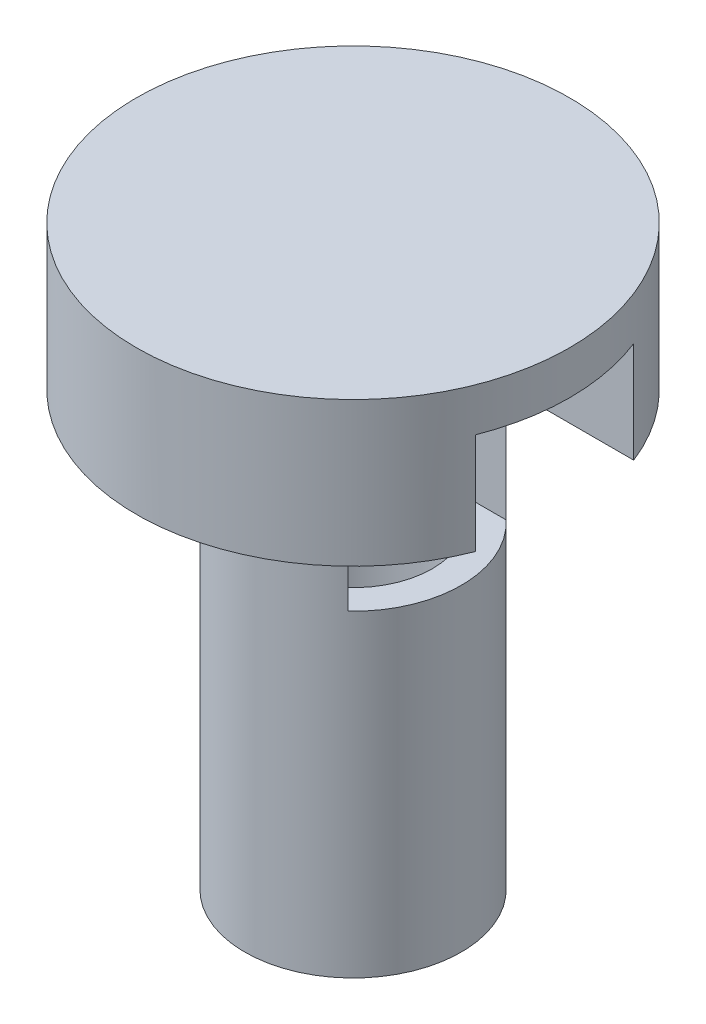
ISO-10303-21;
HEADER;
FILE_DESCRIPTION(('STEP AP214'),'2;1');
FILE_NAME('part.step','',(''),(''),'','','');
FILE_SCHEMA(('AUTOMOTIVE_DESIGN { 1 0 10303 214 1 1 1 1 }'));
ENDSEC;
DATA;
#1=APPLICATION_CONTEXT('core data for automotive mechanical design processes');
#2=APPLICATION_PROTOCOL_DEFINITION('international standard','automotive_design',2000,#1);
#3=PRODUCT_CONTEXT('',#1,'mechanical');
#4=PRODUCT('Part','Part','',(#3));
#5=PRODUCT_RELATED_PRODUCT_CATEGORY('part','',(#4));
#6=PRODUCT_DEFINITION_FORMATION('','',#4);
#7=PRODUCT_DEFINITION_CONTEXT('part definition',#1,'design');
#8=PRODUCT_DEFINITION('design','',#6,#7);
#9=PRODUCT_DEFINITION_SHAPE('','',#8);
#10=(LENGTH_UNIT() NAMED_UNIT(*) SI_UNIT(.MILLI.,.METRE.));
#11=(NAMED_UNIT(*) PLANE_ANGLE_UNIT() SI_UNIT($,.RADIAN.));
#12=(NAMED_UNIT(*) SI_UNIT($,.STERADIAN.) SOLID_ANGLE_UNIT());
#13=UNCERTAINTY_MEASURE_WITH_UNIT(LENGTH_MEASURE(1.E-05),#10,'distance_accuracy_value','');
#14=(GEOMETRIC_REPRESENTATION_CONTEXT(3) GLOBAL_UNCERTAINTY_ASSIGNED_CONTEXT((#13)) GLOBAL_UNIT_ASSIGNED_CONTEXT((#10,
#11,#12)) REPRESENTATION_CONTEXT('',''));
#15=CARTESIAN_POINT('',(0.,0.,0.));
#16=DIRECTION('',(0.,0.,1.));
#17=DIRECTION('',(1.,0.,0.));
#18=AXIS2_PLACEMENT_3D('',#15,#16,#17);
#19=CARTESIAN_POINT('',(0.,12.7,0.));
#20=DIRECTION('',(0.,-1.,0.));
#21=DIRECTION('',(0.,0.,-1.));
#22=AXIS2_PLACEMENT_3D('',#19,#20,#21);
#23=CYLINDRICAL_SURFACE('',#22,19.05);
#24=CARTESIAN_POINT('',(0.,12.7,0.));
#25=DIRECTION('',(0.,1.,0.));
#26=DIRECTION('',(0.,0.,1.));
#27=AXIS2_PLACEMENT_3D('',#24,#25,#26);
#28=CIRCLE('',#27,19.05);
#29=CARTESIAN_POINT('',(0.,12.7,19.05));
#30=VERTEX_POINT('',#29);
#31=EDGE_CURVE('E134',#30,#30,#28,.T.);
#32=ORIENTED_EDGE('',*,*,#31,.F.);
#33=EDGE_LOOP('',(#32));
#34=FACE_BOUND('',#33,.T.);
#35=DIRECTION('',(0.,-1.,0.));
#36=VECTOR('',#35,1.);
#37=CARTESIAN_POINT('',(17.7341944640203,12.7,-6.95707170527301));
#38=LINE('',#37,#36);
#39=CARTESIAN_POINT('',(17.7341944640203,0.,-6.95707170527301));
#40=VERTEX_POINT('',#39);
#41=CARTESIAN_POINT('',(17.7341944640203,8.89,-6.95707170527301));
#42=VERTEX_POINT('',#41);
#43=EDGE_CURVE('E95',#40,#42,#38,.F.);
#44=ORIENTED_EDGE('',*,*,#43,.F.);
#45=CARTESIAN_POINT('',(0.,0.,0.));
#46=DIRECTION('',(0.,1.,0.));
#47=DIRECTION('',(0.,0.,1.));
#48=AXIS2_PLACEMENT_3D('',#45,#46,#47);
#49=CIRCLE('',#48,19.05);
#50=CARTESIAN_POINT('',(17.7341944640203,0.,6.95707170527301));
#51=VERTEX_POINT('',#50);
#52=EDGE_CURVE('E108',#40,#51,#49,.T.);
#53=ORIENTED_EDGE('',*,*,#52,.T.);
#54=DIRECTION('',(0.,-1.,0.));
#55=VECTOR('',#54,1.);
#56=CARTESIAN_POINT('',(17.7341944640203,12.7,6.95707170527301));
#57=LINE('',#56,#55);
#58=CARTESIAN_POINT('',(17.7341944640203,8.89,6.95707170527301));
#59=VERTEX_POINT('',#58);
#60=EDGE_CURVE('E99',#59,#51,#57,.T.);
#61=ORIENTED_EDGE('',*,*,#60,.F.);
#62=CARTESIAN_POINT('',(0.,8.89,0.));
#63=DIRECTION('',(0.,-1.,0.));
#64=DIRECTION('',(0.,0.,-1.));
#65=AXIS2_PLACEMENT_3D('',#62,#63,#64);
#66=CIRCLE('',#65,19.05);
#67=EDGE_CURVE('E88',#42,#59,#66,.T.);
#68=ORIENTED_EDGE('',*,*,#67,.F.);
#69=EDGE_LOOP('',(#44,#53,#61,#68));
#70=FACE_BOUND('',#69,.T.);
#71=ADVANCED_FACE('F36',(#34,#70),#23,.T.);
#72=CARTESIAN_POINT('',(0.,0.,0.));
#73=DIRECTION('',(0.,1.,0.));
#74=DIRECTION('',(0.,0.,1.));
#75=AXIS2_PLACEMENT_3D('',#72,#73,#74);
#76=PLANE('',#75);
#77=DIRECTION('',(1.,0.,0.));
#78=VECTOR('',#77,1.);
#79=CARTESIAN_POINT('',(0.,0.,-6.95707170527301));
#80=LINE('',#79,#78);
#81=CARTESIAN_POINT('',(6.50574963303151,0.,-6.95707170527301));
#82=VERTEX_POINT('',#81);
#83=EDGE_CURVE('E119',#82,#40,#80,.T.);
#84=ORIENTED_EDGE('',*,*,#83,.F.);
#85=CARTESIAN_POINT('',(0.,0.,0.));
#86=DIRECTION('',(0.,-1.,0.));
#87=DIRECTION('',(0.,0.,-1.));
#88=AXIS2_PLACEMENT_3D('',#85,#86,#87);
#89=CIRCLE('',#88,9.525);
#90=CARTESIAN_POINT('',(6.50574963303151,0.,6.95707170527301));
#91=VERTEX_POINT('',#90);
#92=EDGE_CURVE('E43',#91,#82,#89,.T.);
#93=ORIENTED_EDGE('',*,*,#92,.F.);
#94=DIRECTION('',(-1.,0.,0.));
#95=VECTOR('',#94,1.);
#96=CARTESIAN_POINT('',(0.,0.,6.95707170527301));
#97=LINE('',#96,#95);
#98=EDGE_CURVE('E110',#51,#91,#97,.T.);
#99=ORIENTED_EDGE('',*,*,#98,.F.);
#100=ORIENTED_EDGE('',*,*,#52,.F.);
#101=EDGE_LOOP('',(#84,#93,#99,#100));
#102=FACE_BOUND('',#101,.T.);
#103=ADVANCED_FACE('F141',(#102),#76,.F.);
#104=CARTESIAN_POINT('',(0.,-38.1,0.));
#105=DIRECTION('',(0.,1.,0.));
#106=DIRECTION('',(0.,0.,1.));
#107=AXIS2_PLACEMENT_3D('',#104,#105,#106);
#108=CYLINDRICAL_SURFACE('',#107,9.525);
#109=CARTESIAN_POINT('',(0.,-38.1,0.));
#110=DIRECTION('',(0.,-1.,0.));
#111=DIRECTION('',(0.,0.,-1.));
#112=AXIS2_PLACEMENT_3D('',#109,#110,#111);
#113=CIRCLE('',#112,9.525);
#114=CARTESIAN_POINT('',(0.,-38.1,-9.525));
#115=VERTEX_POINT('',#114);
#116=EDGE_CURVE('E127',#115,#115,#113,.T.);
#117=ORIENTED_EDGE('',*,*,#116,.F.);
#118=EDGE_LOOP('',(#117));
#119=FACE_BOUND('',#118,.T.);
#120=DIRECTION('',(0.,1.,0.));
#121=VECTOR('',#120,1.);
#122=CARTESIAN_POINT('',(6.50574963303151,-38.1,-6.95707170527301));
#123=LINE('',#122,#121);
#124=CARTESIAN_POINT('',(6.50574963303151,-10.16,-6.95707170527301));
#125=VERTEX_POINT('',#124);
#126=EDGE_CURVE('E112',#125,#82,#123,.T.);
#127=ORIENTED_EDGE('',*,*,#126,.F.);
#128=CARTESIAN_POINT('',(0.,-10.16,0.));
#129=DIRECTION('',(0.,-1.,0.));
#130=DIRECTION('',(0.,0.,-1.));
#131=AXIS2_PLACEMENT_3D('',#128,#129,#130);
#132=CIRCLE('',#131,9.525);
#133=CARTESIAN_POINT('',(6.50574963303151,-10.16,6.95707170527301));
#134=VERTEX_POINT('',#133);
#135=EDGE_CURVE('E94',#125,#134,#132,.T.);
#136=ORIENTED_EDGE('',*,*,#135,.T.);
#137=DIRECTION('',(0.,1.,0.));
#138=VECTOR('',#137,1.);
#139=CARTESIAN_POINT('',(6.50574963303151,-38.1,6.95707170527301));
#140=LINE('',#139,#138);
#141=EDGE_CURVE('E114',#91,#134,#140,.F.);
#142=ORIENTED_EDGE('',*,*,#141,.F.);
#143=ORIENTED_EDGE('',*,*,#92,.T.);
#144=EDGE_LOOP('',(#127,#136,#142,#143));
#145=FACE_BOUND('',#144,.T.);
#146=ADVANCED_FACE('F145',(#119,#145),#108,.T.);
#147=CARTESIAN_POINT('',(0.,8.89,0.));
#148=DIRECTION('',(0.,-1.,0.));
#149=DIRECTION('',(0.,0.,-1.));
#150=AXIS2_PLACEMENT_3D('',#147,#148,#149);
#151=CYLINDRICAL_SURFACE('',#150,6.985);
#152=CARTESIAN_POINT('',(0.,-38.1,0.));
#153=DIRECTION('',(0.,-1.,0.));
#154=DIRECTION('',(0.,0.,-1.));
#155=AXIS2_PLACEMENT_3D('',#152,#153,#154);
#156=CIRCLE('',#155,6.985);
#157=CARTESIAN_POINT('',(0.,-38.1,-6.985));
#158=VERTEX_POINT('',#157);
#159=EDGE_CURVE('E124',#158,#158,#156,.T.);
#160=ORIENTED_EDGE('',*,*,#159,.T.);
#161=EDGE_LOOP('',(#160));
#162=FACE_BOUND('',#161,.T.);
#163=DIRECTION('',(0.,-1.,0.));
#164=VECTOR('',#163,1.);
#165=CARTESIAN_POINT('',(0.62400183308198,8.89,-6.95707170527301));
#166=LINE('',#165,#164);
#167=CARTESIAN_POINT('',(0.624001833081964,8.89,-6.95707170527301));
#168=VERTEX_POINT('',#167);
#169=CARTESIAN_POINT('',(0.624001833081964,-10.16,-6.95707170527301));
#170=VERTEX_POINT('',#169);
#171=EDGE_CURVE('E109',#168,#170,#166,.T.);
#172=ORIENTED_EDGE('',*,*,#171,.F.);
#173=CARTESIAN_POINT('',(0.,8.89,0.));
#174=DIRECTION('',(0.,-1.,0.));
#175=DIRECTION('',(0.,0.,-1.));
#176=AXIS2_PLACEMENT_3D('',#173,#174,#175);
#177=CIRCLE('',#176,6.985);
#178=CARTESIAN_POINT('',(0.624001833081964,8.89,6.95707170527301));
#179=VERTEX_POINT('',#178);
#180=EDGE_CURVE('E125',#179,#168,#177,.T.);
#181=ORIENTED_EDGE('',*,*,#180,.F.);
#182=DIRECTION('',(0.,-1.,0.));
#183=VECTOR('',#182,1.);
#184=CARTESIAN_POINT('',(0.62400183308198,8.89,6.95707170527301));
#185=LINE('',#184,#183);
#186=CARTESIAN_POINT('',(0.624001833081964,-10.16,6.95707170527301));
#187=VERTEX_POINT('',#186);
#188=EDGE_CURVE('E102',#187,#179,#185,.F.);
#189=ORIENTED_EDGE('',*,*,#188,.F.);
#190=CARTESIAN_POINT('',(0.,-10.16,0.));
#191=DIRECTION('',(0.,-1.,0.));
#192=DIRECTION('',(0.,0.,-1.));
#193=AXIS2_PLACEMENT_3D('',#190,#191,#192);
#194=CIRCLE('',#193,6.985);
#195=EDGE_CURVE('E11',#187,#170,#194,.F.);
#196=ORIENTED_EDGE('',*,*,#195,.T.);
#197=EDGE_LOOP('',(#172,#181,#189,#196));
#198=FACE_BOUND('',#197,.T.);
#199=ADVANCED_FACE('F150',(#162,#198),#151,.F.);
#200=CARTESIAN_POINT('',(0.,12.7,0.));
#201=DIRECTION('',(0.,1.,0.));
#202=DIRECTION('',(0.,0.,1.));
#203=AXIS2_PLACEMENT_3D('',#200,#201,#202);
#204=PLANE('',#203);
#205=ORIENTED_EDGE('',*,*,#31,.T.);
#206=EDGE_LOOP('',(#205));
#207=FACE_BOUND('',#206,.T.);
#208=ADVANCED_FACE('F138',(#207),#204,.T.);
#209=CARTESIAN_POINT('',(0.,-38.1,0.));
#210=DIRECTION('',(0.,-1.,0.));
#211=DIRECTION('',(0.,0.,-1.));
#212=AXIS2_PLACEMENT_3D('',#209,#210,#211);
#213=PLANE('',#212);
#214=ORIENTED_EDGE('',*,*,#159,.F.);
#215=EDGE_LOOP('',(#214));
#216=FACE_BOUND('',#215,.T.);
#217=ORIENTED_EDGE('',*,*,#116,.T.);
#218=EDGE_LOOP('',(#217));
#219=FACE_BOUND('',#218,.T.);
#220=ADVANCED_FACE('F156',(#216,#219),#213,.T.);
#221=CARTESIAN_POINT('',(0.,8.89,0.));
#222=DIRECTION('',(0.,-1.,0.));
#223=DIRECTION('',(0.,0.,-1.));
#224=AXIS2_PLACEMENT_3D('',#221,#222,#223);
#225=PLANE('',#224);
#226=ORIENTED_EDGE('',*,*,#180,.T.);
#227=DIRECTION('',(1.,0.,0.));
#228=VECTOR('',#227,1.);
#229=CARTESIAN_POINT('',(0.,8.89,-6.95707170527301));
#230=LINE('',#229,#228);
#231=EDGE_CURVE('E90',#168,#42,#230,.T.);
#232=ORIENTED_EDGE('',*,*,#231,.T.);
#233=ORIENTED_EDGE('',*,*,#67,.T.);
#234=DIRECTION('',(-1.,0.,0.));
#235=VECTOR('',#234,1.);
#236=CARTESIAN_POINT('',(0.,8.89,6.95707170527301));
#237=LINE('',#236,#235);
#238=EDGE_CURVE('E58',#59,#179,#237,.T.);
#239=ORIENTED_EDGE('',*,*,#238,.T.);
#240=EDGE_LOOP('',(#226,#232,#233,#239));
#241=FACE_BOUND('',#240,.T.);
#242=ADVANCED_FACE('F89',(#241),#225,.T.);
#243=CARTESIAN_POINT('',(0.,-10.16,0.));
#244=DIRECTION('',(0.,-1.,0.));
#245=DIRECTION('',(0.,0.,-1.));
#246=AXIS2_PLACEMENT_3D('',#243,#244,#245);
#247=PLANE('',#246);
#248=DIRECTION('',(1.,0.,0.));
#249=VECTOR('',#248,1.);
#250=CARTESIAN_POINT('',(0.,-10.16,-6.95707170527301));
#251=LINE('',#250,#249);
#252=EDGE_CURVE('E104',#170,#125,#251,.T.);
#253=ORIENTED_EDGE('',*,*,#252,.F.);
#254=ORIENTED_EDGE('',*,*,#195,.F.);
#255=DIRECTION('',(-1.,0.,0.));
#256=VECTOR('',#255,1.);
#257=CARTESIAN_POINT('',(0.,-10.16,6.95707170527301));
#258=LINE('',#257,#256);
#259=EDGE_CURVE('E50',#134,#187,#258,.T.);
#260=ORIENTED_EDGE('',*,*,#259,.F.);
#261=ORIENTED_EDGE('',*,*,#135,.F.);
#262=EDGE_LOOP('',(#253,#254,#260,#261));
#263=FACE_BOUND('',#262,.T.);
#264=ADVANCED_FACE('F166',(#263),#247,.F.);
#265=CARTESIAN_POINT('',(0.,-10.16,-6.95707170527301));
#266=DIRECTION('',(0.,0.,1.));
#267=DIRECTION('',(1.,0.,0.));
#268=AXIS2_PLACEMENT_3D('',#265,#266,#267);
#269=PLANE('',#268);
#270=ORIENTED_EDGE('',*,*,#43,.T.);
#271=ORIENTED_EDGE('',*,*,#231,.F.);
#272=ORIENTED_EDGE('',*,*,#171,.T.);
#273=ORIENTED_EDGE('',*,*,#252,.T.);
#274=ORIENTED_EDGE('',*,*,#126,.T.);
#275=ORIENTED_EDGE('',*,*,#83,.T.);
#276=EDGE_LOOP('',(#270,#271,#272,#273,#274,#275));
#277=FACE_BOUND('',#276,.T.);
#278=ADVANCED_FACE('F167',(#277),#269,.T.);
#279=CARTESIAN_POINT('',(0.,-10.16,6.95707170527301));
#280=DIRECTION('',(0.,0.,-1.));
#281=DIRECTION('',(-1.,0.,0.));
#282=AXIS2_PLACEMENT_3D('',#279,#280,#281);
#283=PLANE('',#282);
#284=ORIENTED_EDGE('',*,*,#60,.T.);
#285=ORIENTED_EDGE('',*,*,#98,.T.);
#286=ORIENTED_EDGE('',*,*,#141,.T.);
#287=ORIENTED_EDGE('',*,*,#259,.T.);
#288=ORIENTED_EDGE('',*,*,#188,.T.);
#289=ORIENTED_EDGE('',*,*,#238,.F.);
#290=EDGE_LOOP('',(#284,#285,#286,#287,#288,#289));
#291=FACE_BOUND('',#290,.T.);
#292=ADVANCED_FACE('F98',(#291),#283,.T.);
#293=CLOSED_SHELL('',(#71,#103,#146,#199,#208,#220,#242,#264,#278,#292));
#294=MANIFOLD_SOLID_BREP('B2',#293);
#295=ADVANCED_BREP_SHAPE_REPRESENTATION('',(#18,#294),#14);
#296=SHAPE_DEFINITION_REPRESENTATION(#9,#295);
ENDSEC;
END-ISO-10303-21;
